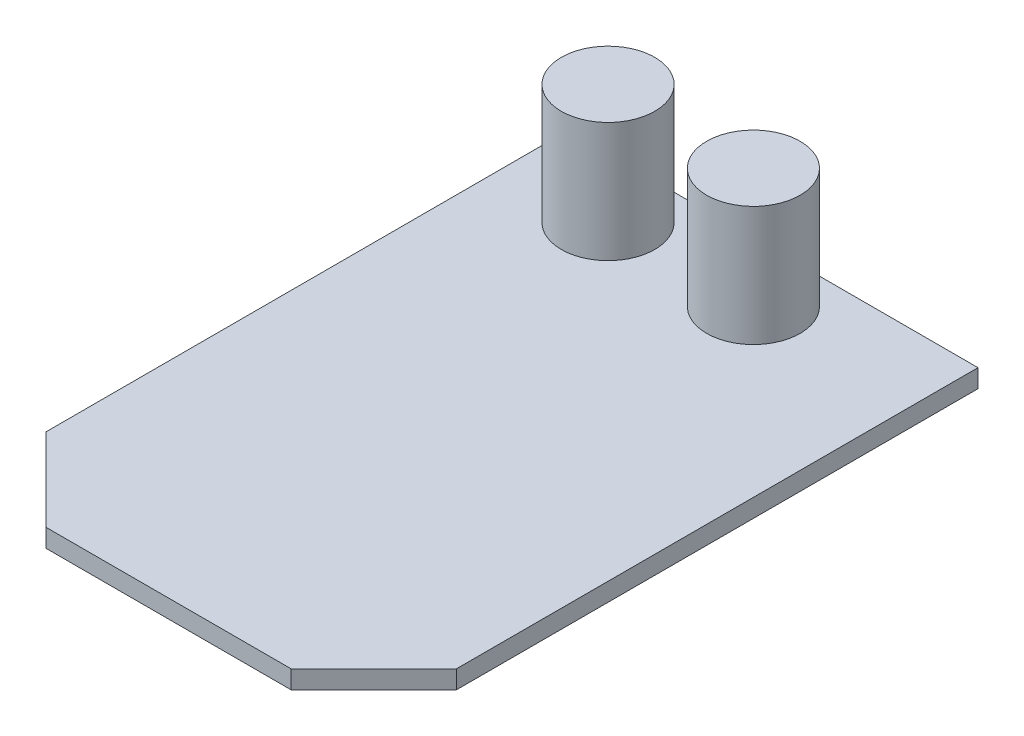
ISO-10303-21;
HEADER;
FILE_DESCRIPTION(('STEP AP214'),'2;1');
FILE_NAME('part.step','',(''),(''),'','','');
FILE_SCHEMA(('AUTOMOTIVE_DESIGN { 1 0 10303 214 1 1 1 1 }'));
ENDSEC;
DATA;
#1=APPLICATION_CONTEXT('core data for automotive mechanical design processes');
#2=APPLICATION_PROTOCOL_DEFINITION('international standard','automotive_design',2000,#1);
#3=PRODUCT_CONTEXT('',#1,'mechanical');
#4=PRODUCT('Part','Part','',(#3));
#5=PRODUCT_RELATED_PRODUCT_CATEGORY('part','',(#4));
#6=PRODUCT_DEFINITION_FORMATION('','',#4);
#7=PRODUCT_DEFINITION_CONTEXT('part definition',#1,'design');
#8=PRODUCT_DEFINITION('design','',#6,#7);
#9=PRODUCT_DEFINITION_SHAPE('','',#8);
#10=(LENGTH_UNIT() NAMED_UNIT(*) SI_UNIT(.MILLI.,.METRE.));
#11=(NAMED_UNIT(*) PLANE_ANGLE_UNIT() SI_UNIT($,.RADIAN.));
#12=(NAMED_UNIT(*) SI_UNIT($,.STERADIAN.) SOLID_ANGLE_UNIT());
#13=UNCERTAINTY_MEASURE_WITH_UNIT(LENGTH_MEASURE(1.E-05),#10,'distance_accuracy_value','');
#14=(GEOMETRIC_REPRESENTATION_CONTEXT(3) GLOBAL_UNCERTAINTY_ASSIGNED_CONTEXT((#13)) GLOBAL_UNIT_ASSIGNED_CONTEXT((#10,
#11,#12)) REPRESENTATION_CONTEXT('',''));
#15=CARTESIAN_POINT('',(0.,0.,0.));
#16=DIRECTION('',(0.,0.,1.));
#17=DIRECTION('',(1.,0.,0.));
#18=AXIS2_PLACEMENT_3D('',#15,#16,#17);
#19=CARTESIAN_POINT('',(0.,0.,0.));
#20=DIRECTION('',(0.,1.,0.));
#21=DIRECTION('',(0.,0.,1.));
#22=AXIS2_PLACEMENT_3D('',#19,#20,#21);
#23=PLANE('',#22);
#24=DIRECTION('',(-0.707106781186548,0.,0.707106781186548));
#25=VECTOR('',#24,1.);
#26=CARTESIAN_POINT('',(18.6249999999999,0.,18.6249999999999));
#27=LINE('',#26,#25);
#28=CARTESIAN_POINT('',(17.9999999999999,0.,19.2499999999999));
#29=VERTEX_POINT('',#28);
#30=CARTESIAN_POINT('',(10.7499999999999,0.,26.5));
#31=VERTEX_POINT('',#30);
#32=EDGE_CURVE('E133',#29,#31,#27,.T.);
#33=ORIENTED_EDGE('',*,*,#32,.T.);
#34=DIRECTION('',(1.,0.,0.));
#35=VECTOR('',#34,1.);
#36=CARTESIAN_POINT('',(0.,0.,26.5));
#37=LINE('',#36,#35);
#38=CARTESIAN_POINT('',(-10.7500000000001,0.,26.4999999999999));
#39=VERTEX_POINT('',#38);
#40=EDGE_CURVE('E146',#39,#31,#37,.T.);
#41=ORIENTED_EDGE('',*,*,#40,.F.);
#42=DIRECTION('',(0.707106781186548,0.,0.707106781186548));
#43=VECTOR('',#42,1.);
#44=CARTESIAN_POINT('',(-18.625,0.,18.625));
#45=LINE('',#44,#43);
#46=CARTESIAN_POINT('',(-18.0000000000001,0.,19.25));
#47=VERTEX_POINT('',#46);
#48=EDGE_CURVE('E167',#47,#39,#45,.T.);
#49=ORIENTED_EDGE('',*,*,#48,.F.);
#50=DIRECTION('',(0.,0.,-1.));
#51=VECTOR('',#50,1.);
#52=CARTESIAN_POINT('',(-18.,0.,0.));
#53=LINE('',#52,#51);
#54=CARTESIAN_POINT('',(-18.,0.,-26.5));
#55=VERTEX_POINT('',#54);
#56=EDGE_CURVE('E164',#47,#55,#53,.T.);
#57=ORIENTED_EDGE('',*,*,#56,.T.);
#58=DIRECTION('',(1.,0.,0.));
#59=VECTOR('',#58,1.);
#60=CARTESIAN_POINT('',(0.,0.,-26.5));
#61=LINE('',#60,#59);
#62=CARTESIAN_POINT('',(17.9999999999999,0.,-26.5));
#63=VERTEX_POINT('',#62);
#64=EDGE_CURVE('E161',#55,#63,#61,.T.);
#65=ORIENTED_EDGE('',*,*,#64,.T.);
#66=DIRECTION('',(0.,0.,-1.));
#67=VECTOR('',#66,1.);
#68=CARTESIAN_POINT('',(17.9999999999999,0.,0.));
#69=LINE('',#68,#67);
#70=EDGE_CURVE('E136',#29,#63,#69,.T.);
#71=ORIENTED_EDGE('',*,*,#70,.F.);
#72=EDGE_LOOP('',(#33,#41,#49,#57,#65,#71));
#73=FACE_BOUND('',#72,.T.);
#74=DIRECTION('',(0.,0.,-1.));
#75=VECTOR('',#74,1.);
#76=CARTESIAN_POINT('',(-15.,0.,-12.2000000000001));
#77=LINE('',#76,#75);
#78=CARTESIAN_POINT('',(-15.,0.,-12.2000000000001));
#79=VERTEX_POINT('',#78);
#80=CARTESIAN_POINT('',(-15.,0.,-17.2000000000001));
#81=VERTEX_POINT('',#80);
#82=EDGE_CURVE('E132',#79,#81,#77,.T.);
#83=ORIENTED_EDGE('',*,*,#82,.F.);
#84=DIRECTION('',(-1.,0.,0.));
#85=VECTOR('',#84,1.);
#86=CARTESIAN_POINT('',(15.,0.,-12.2));
#87=LINE('',#86,#85);
#88=CARTESIAN_POINT('',(15.,0.,-12.2));
#89=VERTEX_POINT('',#88);
#90=EDGE_CURVE('E129',#89,#79,#87,.T.);
#91=ORIENTED_EDGE('',*,*,#90,.F.);
#92=DIRECTION('',(0.,0.,1.));
#93=VECTOR('',#92,1.);
#94=CARTESIAN_POINT('',(15.,0.,-12.2));
#95=LINE('',#94,#93);
#96=CARTESIAN_POINT('',(15.,0.,-17.2));
#97=VERTEX_POINT('',#96);
#98=EDGE_CURVE('E56',#97,#89,#95,.T.);
#99=ORIENTED_EDGE('',*,*,#98,.F.);
#100=DIRECTION('',(1.,0.,0.));
#101=VECTOR('',#100,1.);
#102=CARTESIAN_POINT('',(15.,0.,-17.2));
#103=LINE('',#102,#101);
#104=EDGE_CURVE('E51',#81,#97,#103,.T.);
#105=ORIENTED_EDGE('',*,*,#104,.F.);
#106=EDGE_LOOP('',(#83,#91,#99,#105));
#107=FACE_BOUND('',#106,.T.);
#108=ADVANCED_FACE('F36',(#73,#107),#23,.F.);
#109=CARTESIAN_POINT('',(18.6249999999999,1.6,18.6249999999999));
#110=DIRECTION('',(0.707106781186548,0.,0.707106781186548));
#111=DIRECTION('',(0.707106781186548,0.,-0.707106781186548));
#112=AXIS2_PLACEMENT_3D('',#109,#110,#111);
#113=PLANE('',#112);
#114=ORIENTED_EDGE('',*,*,#32,.F.);
#115=DIRECTION('',(0.,-1.,0.));
#116=VECTOR('',#115,1.);
#117=CARTESIAN_POINT('',(17.9999999999999,1.6,19.2499999999999));
#118=LINE('',#117,#116);
#119=CARTESIAN_POINT('',(17.9999999999999,1.6,19.2499999999999));
#120=VERTEX_POINT('',#119);
#121=EDGE_CURVE('E11',#120,#29,#118,.T.);
#122=ORIENTED_EDGE('',*,*,#121,.F.);
#123=DIRECTION('',(-0.707106781186548,0.,0.707106781186548));
#124=VECTOR('',#123,1.);
#125=CARTESIAN_POINT('',(18.6249999999999,1.6,18.6249999999999));
#126=LINE('',#125,#124);
#127=CARTESIAN_POINT('',(10.7499999999999,1.6,26.5));
#128=VERTEX_POINT('',#127);
#129=EDGE_CURVE('E142',#120,#128,#126,.T.);
#130=ORIENTED_EDGE('',*,*,#129,.T.);
#131=DIRECTION('',(0.,-1.,0.));
#132=VECTOR('',#131,1.);
#133=CARTESIAN_POINT('',(10.7499999999999,1.6,26.5));
#134=LINE('',#133,#132);
#135=EDGE_CURVE('E157',#128,#31,#134,.T.);
#136=ORIENTED_EDGE('',*,*,#135,.T.);
#137=EDGE_LOOP('',(#114,#122,#130,#136));
#138=FACE_BOUND('',#137,.T.);
#139=ADVANCED_FACE('F38',(#138),#113,.T.);
#140=CARTESIAN_POINT('',(17.9999999999999,1.6,0.));
#141=DIRECTION('',(-1.,0.,0.));
#142=DIRECTION('',(0.,0.,1.));
#143=AXIS2_PLACEMENT_3D('',#140,#141,#142);
#144=PLANE('',#143);
#145=ORIENTED_EDGE('',*,*,#70,.T.);
#146=DIRECTION('',(0.,-1.,0.));
#147=VECTOR('',#146,1.);
#148=CARTESIAN_POINT('',(17.9999999999999,1.6,-26.5));
#149=LINE('',#148,#147);
#150=CARTESIAN_POINT('',(17.9999999999999,1.6,-26.5));
#151=VERTEX_POINT('',#150);
#152=EDGE_CURVE('E44',#151,#63,#149,.T.);
#153=ORIENTED_EDGE('',*,*,#152,.F.);
#154=DIRECTION('',(0.,0.,-1.));
#155=VECTOR('',#154,1.);
#156=CARTESIAN_POINT('',(17.9999999999999,1.6,0.));
#157=LINE('',#156,#155);
#158=EDGE_CURVE('E145',#120,#151,#157,.T.);
#159=ORIENTED_EDGE('',*,*,#158,.F.);
#160=ORIENTED_EDGE('',*,*,#121,.T.);
#161=EDGE_LOOP('',(#145,#153,#159,#160));
#162=FACE_BOUND('',#161,.T.);
#163=ADVANCED_FACE('F186',(#162),#144,.F.);
#164=CARTESIAN_POINT('',(0.,1.6,-26.5));
#165=DIRECTION('',(0.,0.,-1.));
#166=DIRECTION('',(-1.,0.,0.));
#167=AXIS2_PLACEMENT_3D('',#164,#165,#166);
#168=PLANE('',#167);
#169=ORIENTED_EDGE('',*,*,#64,.F.);
#170=DIRECTION('',(0.,-1.,0.));
#171=VECTOR('',#170,1.);
#172=CARTESIAN_POINT('',(-18.,1.6,-26.5));
#173=LINE('',#172,#171);
#174=CARTESIAN_POINT('',(-18.,1.6,-26.5));
#175=VERTEX_POINT('',#174);
#176=EDGE_CURVE('E177',#175,#55,#173,.T.);
#177=ORIENTED_EDGE('',*,*,#176,.F.);
#178=DIRECTION('',(1.,0.,0.));
#179=VECTOR('',#178,1.);
#180=CARTESIAN_POINT('',(0.,1.6,-26.5));
#181=LINE('',#180,#179);
#182=EDGE_CURVE('E148',#175,#151,#181,.T.);
#183=ORIENTED_EDGE('',*,*,#182,.T.);
#184=ORIENTED_EDGE('',*,*,#152,.T.);
#185=EDGE_LOOP('',(#169,#177,#183,#184));
#186=FACE_BOUND('',#185,.T.);
#187=ADVANCED_FACE('F181',(#186),#168,.T.);
#188=CARTESIAN_POINT('',(-18.,1.6,0.));
#189=DIRECTION('',(-1.,0.,0.));
#190=DIRECTION('',(0.,0.,1.));
#191=AXIS2_PLACEMENT_3D('',#188,#189,#190);
#192=PLANE('',#191);
#193=ORIENTED_EDGE('',*,*,#56,.F.);
#194=DIRECTION('',(0.,-1.,0.));
#195=VECTOR('',#194,1.);
#196=CARTESIAN_POINT('',(-18.0000000000001,1.6,19.25));
#197=LINE('',#196,#195);
#198=CARTESIAN_POINT('',(-18.0000000000001,1.6,19.25));
#199=VERTEX_POINT('',#198);
#200=EDGE_CURVE('E175',#199,#47,#197,.T.);
#201=ORIENTED_EDGE('',*,*,#200,.F.);
#202=DIRECTION('',(0.,0.,-1.));
#203=VECTOR('',#202,1.);
#204=CARTESIAN_POINT('',(-18.,1.6,0.));
#205=LINE('',#204,#203);
#206=EDGE_CURVE('E151',#199,#175,#205,.T.);
#207=ORIENTED_EDGE('',*,*,#206,.T.);
#208=ORIENTED_EDGE('',*,*,#176,.T.);
#209=EDGE_LOOP('',(#193,#201,#207,#208));
#210=FACE_BOUND('',#209,.T.);
#211=ADVANCED_FACE('F193',(#210),#192,.T.);
#212=CARTESIAN_POINT('',(-18.625,1.6,18.625));
#213=DIRECTION('',(0.707106781186548,0.,-0.707106781186548));
#214=DIRECTION('',(-0.707106781186548,0.,-0.707106781186548));
#215=AXIS2_PLACEMENT_3D('',#212,#213,#214);
#216=PLANE('',#215);
#217=ORIENTED_EDGE('',*,*,#48,.T.);
#218=DIRECTION('',(0.,-1.,0.));
#219=VECTOR('',#218,1.);
#220=CARTESIAN_POINT('',(-10.7500000000001,1.6,26.4999999999999));
#221=LINE('',#220,#219);
#222=CARTESIAN_POINT('',(-10.7500000000001,1.6,26.4999999999999));
#223=VERTEX_POINT('',#222);
#224=EDGE_CURVE('E172',#223,#39,#221,.T.);
#225=ORIENTED_EDGE('',*,*,#224,.F.);
#226=DIRECTION('',(0.707106781186548,0.,0.707106781186548));
#227=VECTOR('',#226,1.);
#228=CARTESIAN_POINT('',(-18.625,1.6,18.625));
#229=LINE('',#228,#227);
#230=EDGE_CURVE('E154',#199,#223,#229,.T.);
#231=ORIENTED_EDGE('',*,*,#230,.F.);
#232=ORIENTED_EDGE('',*,*,#200,.T.);
#233=EDGE_LOOP('',(#217,#225,#231,#232));
#234=FACE_BOUND('',#233,.T.);
#235=ADVANCED_FACE('F206',(#234),#216,.F.);
#236=CARTESIAN_POINT('',(0.,1.6,26.5));
#237=DIRECTION('',(0.,0.,-1.));
#238=DIRECTION('',(-1.,0.,0.));
#239=AXIS2_PLACEMENT_3D('',#236,#237,#238);
#240=PLANE('',#239);
#241=ORIENTED_EDGE('',*,*,#40,.T.);
#242=ORIENTED_EDGE('',*,*,#135,.F.);
#243=DIRECTION('',(1.,0.,0.));
#244=VECTOR('',#243,1.);
#245=CARTESIAN_POINT('',(0.,1.6,26.5));
#246=LINE('',#245,#244);
#247=EDGE_CURVE('E156',#223,#128,#246,.T.);
#248=ORIENTED_EDGE('',*,*,#247,.F.);
#249=ORIENTED_EDGE('',*,*,#224,.T.);
#250=EDGE_LOOP('',(#241,#242,#248,#249));
#251=FACE_BOUND('',#250,.T.);
#252=ADVANCED_FACE('F203',(#251),#240,.F.);
#253=CARTESIAN_POINT('',(0.,1.6,0.));
#254=DIRECTION('',(0.,1.,0.));
#255=DIRECTION('',(0.,0.,1.));
#256=AXIS2_PLACEMENT_3D('',#253,#254,#255);
#257=PLANE('',#256);
#258=CARTESIAN_POINT('',(3.49999999999991,1.6,-21.3000000000001));
#259=DIRECTION('',(0.,1.,0.));
#260=DIRECTION('',(0.,0.,1.));
#261=AXIS2_PLACEMENT_3D('',#258,#259,#260);
#262=CIRCLE('',#261,4.1);
#263=CARTESIAN_POINT('',(3.49999999999991,1.6,-17.2000000000001));
#264=VERTEX_POINT('',#263);
#265=EDGE_CURVE('E259',#264,#264,#262,.T.);
#266=ORIENTED_EDGE('',*,*,#265,.F.);
#267=EDGE_LOOP('',(#266));
#268=FACE_BOUND('',#267,.T.);
#269=CARTESIAN_POINT('',(-9.25000000000009,1.6,-21.3000000000001));
#270=DIRECTION('',(0.,1.,0.));
#271=DIRECTION('',(0.,0.,1.));
#272=AXIS2_PLACEMENT_3D('',#269,#270,#271);
#273=CIRCLE('',#272,4.1);
#274=CARTESIAN_POINT('',(-9.25000000000009,1.6,-17.2000000000001));
#275=VERTEX_POINT('',#274);
#276=EDGE_CURVE('E258',#275,#275,#273,.T.);
#277=ORIENTED_EDGE('',*,*,#276,.F.);
#278=EDGE_LOOP('',(#277));
#279=FACE_BOUND('',#278,.T.);
#280=ORIENTED_EDGE('',*,*,#129,.F.);
#281=ORIENTED_EDGE('',*,*,#158,.T.);
#282=ORIENTED_EDGE('',*,*,#182,.F.);
#283=ORIENTED_EDGE('',*,*,#206,.F.);
#284=ORIENTED_EDGE('',*,*,#230,.T.);
#285=ORIENTED_EDGE('',*,*,#247,.T.);
#286=EDGE_LOOP('',(#280,#281,#282,#283,#284,#285));
#287=FACE_BOUND('',#286,.T.);
#288=ADVANCED_FACE('F198',(#268,#279,#287),#257,.T.);
#289=CARTESIAN_POINT('',(-15.,-1.15,-12.2000000000001));
#290=DIRECTION('',(1.,0.,0.));
#291=DIRECTION('',(0.,0.,-1.));
#292=AXIS2_PLACEMENT_3D('',#289,#290,#291);
#293=PLANE('',#292);
#294=ORIENTED_EDGE('',*,*,#82,.T.);
#295=DIRECTION('',(0.,1.,0.));
#296=VECTOR('',#295,1.);
#297=CARTESIAN_POINT('',(-15.,-1.15,-17.2000000000001));
#298=LINE('',#297,#296);
#299=CARTESIAN_POINT('',(-15.,-1.15,-17.2000000000001));
#300=VERTEX_POINT('',#299);
#301=EDGE_CURVE('E113',#300,#81,#298,.T.);
#302=ORIENTED_EDGE('',*,*,#301,.F.);
#303=DIRECTION('',(0.,0.,-1.));
#304=VECTOR('',#303,1.);
#305=CARTESIAN_POINT('',(-15.,-1.15,-12.2000000000001));
#306=LINE('',#305,#304);
#307=CARTESIAN_POINT('',(-15.,-1.15,-12.2000000000001));
#308=VERTEX_POINT('',#307);
#309=EDGE_CURVE('E120',#308,#300,#306,.T.);
#310=ORIENTED_EDGE('',*,*,#309,.F.);
#311=DIRECTION('',(0.,1.,0.));
#312=VECTOR('',#311,1.);
#313=CARTESIAN_POINT('',(-15.,-1.15,-12.2000000000001));
#314=LINE('',#313,#312);
#315=EDGE_CURVE('E271',#308,#79,#314,.T.);
#316=ORIENTED_EDGE('',*,*,#315,.T.);
#317=EDGE_LOOP('',(#294,#302,#310,#316));
#318=FACE_BOUND('',#317,.T.);
#319=ADVANCED_FACE('F131',(#318),#293,.F.);
#320=CARTESIAN_POINT('',(15.,-1.15,-17.2));
#321=DIRECTION('',(0.,0.,1.));
#322=DIRECTION('',(1.,0.,0.));
#323=AXIS2_PLACEMENT_3D('',#320,#321,#322);
#324=PLANE('',#323);
#325=ORIENTED_EDGE('',*,*,#104,.T.);
#326=DIRECTION('',(0.,1.,0.));
#327=VECTOR('',#326,1.);
#328=CARTESIAN_POINT('',(15.,-1.15,-17.2));
#329=LINE('',#328,#327);
#330=CARTESIAN_POINT('',(15.,-1.15,-17.2));
#331=VERTEX_POINT('',#330);
#332=EDGE_CURVE('E116',#331,#97,#329,.T.);
#333=ORIENTED_EDGE('',*,*,#332,.F.);
#334=DIRECTION('',(1.,0.,0.));
#335=VECTOR('',#334,1.);
#336=CARTESIAN_POINT('',(15.,-1.15,-17.2));
#337=LINE('',#336,#335);
#338=EDGE_CURVE('E109',#300,#331,#337,.T.);
#339=ORIENTED_EDGE('',*,*,#338,.F.);
#340=ORIENTED_EDGE('',*,*,#301,.T.);
#341=EDGE_LOOP('',(#325,#333,#339,#340));
#342=FACE_BOUND('',#341,.T.);
#343=ADVANCED_FACE('F111',(#342),#324,.F.);
#344=CARTESIAN_POINT('',(15.,-1.15,-12.2));
#345=DIRECTION('',(-1.,0.,0.));
#346=DIRECTION('',(0.,0.,1.));
#347=AXIS2_PLACEMENT_3D('',#344,#345,#346);
#348=PLANE('',#347);
#349=ORIENTED_EDGE('',*,*,#98,.T.);
#350=DIRECTION('',(0.,1.,0.));
#351=VECTOR('',#350,1.);
#352=CARTESIAN_POINT('',(15.,-1.15,-12.2));
#353=LINE('',#352,#351);
#354=CARTESIAN_POINT('',(15.,-1.15,-12.2));
#355=VERTEX_POINT('',#354);
#356=EDGE_CURVE('E138',#355,#89,#353,.T.);
#357=ORIENTED_EDGE('',*,*,#356,.F.);
#358=DIRECTION('',(0.,0.,1.));
#359=VECTOR('',#358,1.);
#360=CARTESIAN_POINT('',(15.,-1.15,-12.2));
#361=LINE('',#360,#359);
#362=EDGE_CURVE('E119',#331,#355,#361,.T.);
#363=ORIENTED_EDGE('',*,*,#362,.F.);
#364=ORIENTED_EDGE('',*,*,#332,.T.);
#365=EDGE_LOOP('',(#349,#357,#363,#364));
#366=FACE_BOUND('',#365,.T.);
#367=ADVANCED_FACE('F228',(#366),#348,.F.);
#368=CARTESIAN_POINT('',(15.,-1.15,-12.2));
#369=DIRECTION('',(0.,0.,-1.));
#370=DIRECTION('',(-1.,0.,0.));
#371=AXIS2_PLACEMENT_3D('',#368,#369,#370);
#372=PLANE('',#371);
#373=ORIENTED_EDGE('',*,*,#90,.T.);
#374=ORIENTED_EDGE('',*,*,#315,.F.);
#375=DIRECTION('',(-1.,0.,0.));
#376=VECTOR('',#375,1.);
#377=CARTESIAN_POINT('',(15.,-1.15,-12.2));
#378=LINE('',#377,#376);
#379=EDGE_CURVE('E125',#355,#308,#378,.T.);
#380=ORIENTED_EDGE('',*,*,#379,.F.);
#381=ORIENTED_EDGE('',*,*,#356,.T.);
#382=EDGE_LOOP('',(#373,#374,#380,#381));
#383=FACE_BOUND('',#382,.T.);
#384=ADVANCED_FACE('F231',(#383),#372,.F.);
#385=CARTESIAN_POINT('',(0.,-1.15,0.));
#386=DIRECTION('',(0.,1.,0.));
#387=DIRECTION('',(0.,0.,1.));
#388=AXIS2_PLACEMENT_3D('',#385,#386,#387);
#389=PLANE('',#388);
#390=ORIENTED_EDGE('',*,*,#309,.T.);
#391=ORIENTED_EDGE('',*,*,#338,.T.);
#392=ORIENTED_EDGE('',*,*,#362,.T.);
#393=ORIENTED_EDGE('',*,*,#379,.T.);
#394=EDGE_LOOP('',(#390,#391,#392,#393));
#395=FACE_BOUND('',#394,.T.);
#396=ADVANCED_FACE('F123',(#395),#389,.F.);
#397=CARTESIAN_POINT('',(-9.25000000000009,12.1,-21.3000000000001));
#398=DIRECTION('',(0.,-1.,0.));
#399=DIRECTION('',(0.,0.,-1.));
#400=AXIS2_PLACEMENT_3D('',#397,#398,#399);
#401=CYLINDRICAL_SURFACE('',#400,4.1);
#402=CARTESIAN_POINT('',(-9.25000000000009,12.1,-21.3000000000001));
#403=DIRECTION('',(0.,1.,0.));
#404=DIRECTION('',(0.,0.,1.));
#405=AXIS2_PLACEMENT_3D('',#402,#403,#404);
#406=CIRCLE('',#405,4.1);
#407=CARTESIAN_POINT('',(-9.25000000000009,12.1,-17.2000000000001));
#408=VERTEX_POINT('',#407);
#409=EDGE_CURVE('E262',#408,#408,#406,.T.);
#410=ORIENTED_EDGE('',*,*,#409,.F.);
#411=EDGE_LOOP('',(#410));
#412=FACE_BOUND('',#411,.T.);
#413=ORIENTED_EDGE('',*,*,#276,.T.);
#414=EDGE_LOOP('',(#413));
#415=FACE_BOUND('',#414,.T.);
#416=ADVANCED_FACE('F238',(#412,#415),#401,.T.);
#417=CARTESIAN_POINT('',(-9.25000000000009,12.1,-21.3000000000001));
#418=DIRECTION('',(0.,1.,0.));
#419=DIRECTION('',(0.,0.,1.));
#420=AXIS2_PLACEMENT_3D('',#417,#418,#419);
#421=PLANE('',#420);
#422=ORIENTED_EDGE('',*,*,#409,.T.);
#423=EDGE_LOOP('',(#422));
#424=FACE_BOUND('',#423,.T.);
#425=ADVANCED_FACE('F241',(#424),#421,.T.);
#426=CARTESIAN_POINT('',(3.49999999999991,12.1,-21.3000000000001));
#427=DIRECTION('',(0.,-1.,0.));
#428=DIRECTION('',(0.,0.,-1.));
#429=AXIS2_PLACEMENT_3D('',#426,#427,#428);
#430=CYLINDRICAL_SURFACE('',#429,4.1);
#431=CARTESIAN_POINT('',(3.49999999999991,12.1,-21.3000000000001));
#432=DIRECTION('',(0.,1.,0.));
#433=DIRECTION('',(0.,0.,1.));
#434=AXIS2_PLACEMENT_3D('',#431,#432,#433);
#435=CIRCLE('',#434,4.1);
#436=CARTESIAN_POINT('',(3.49999999999991,12.1,-17.2000000000001));
#437=VERTEX_POINT('',#436);
#438=EDGE_CURVE('E257',#437,#437,#435,.T.);
#439=ORIENTED_EDGE('',*,*,#438,.F.);
#440=EDGE_LOOP('',(#439));
#441=FACE_BOUND('',#440,.T.);
#442=ORIENTED_EDGE('',*,*,#265,.T.);
#443=EDGE_LOOP('',(#442));
#444=FACE_BOUND('',#443,.T.);
#445=ADVANCED_FACE('F245',(#441,#444),#430,.T.);
#446=CARTESIAN_POINT('',(3.49999999999991,12.1,-21.3000000000001));
#447=DIRECTION('',(0.,1.,0.));
#448=DIRECTION('',(0.,0.,1.));
#449=AXIS2_PLACEMENT_3D('',#446,#447,#448);
#450=PLANE('',#449);
#451=ORIENTED_EDGE('',*,*,#438,.T.);
#452=EDGE_LOOP('',(#451));
#453=FACE_BOUND('',#452,.T.);
#454=ADVANCED_FACE('F249',(#453),#450,.T.);
#455=CLOSED_SHELL('',(#108,#139,#163,#187,#211,#235,#252,#288,#319,#343,#367,#384,#396,#416,
#425,#445,#454));
#456=MANIFOLD_SOLID_BREP('B2',#455);
#457=ADVANCED_BREP_SHAPE_REPRESENTATION('',(#18,#456),#14);
#458=SHAPE_DEFINITION_REPRESENTATION(#9,#457);
ENDSEC;
END-ISO-10303-21;
